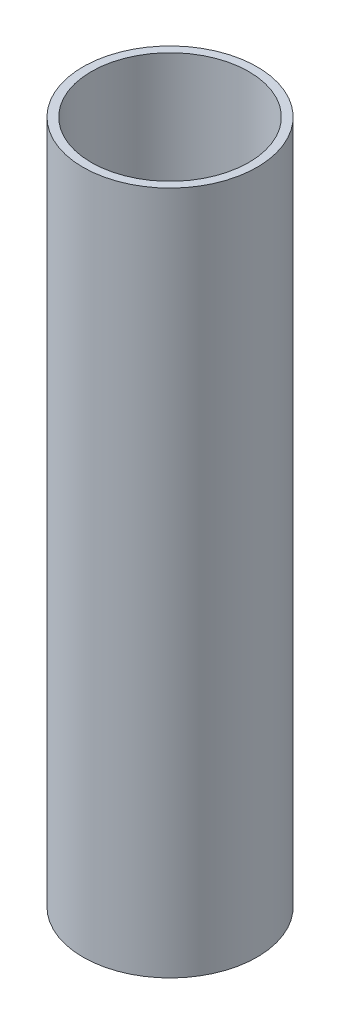
ISO-10303-21;
HEADER;
FILE_DESCRIPTION(('STEP AP214'),'2;1');
FILE_NAME('part.step','',(''),(''),'','','');
FILE_SCHEMA(('AUTOMOTIVE_DESIGN { 1 0 10303 214 1 1 1 1 }'));
ENDSEC;
DATA;
#1=APPLICATION_CONTEXT('core data for automotive mechanical design processes');
#2=APPLICATION_PROTOCOL_DEFINITION('international standard','automotive_design',2000,#1);
#3=PRODUCT_CONTEXT('',#1,'mechanical');
#4=PRODUCT('Part','Part','',(#3));
#5=PRODUCT_RELATED_PRODUCT_CATEGORY('part','',(#4));
#6=PRODUCT_DEFINITION_FORMATION('','',#4);
#7=PRODUCT_DEFINITION_CONTEXT('part definition',#1,'design');
#8=PRODUCT_DEFINITION('design','',#6,#7);
#9=PRODUCT_DEFINITION_SHAPE('','',#8);
#10=(LENGTH_UNIT() NAMED_UNIT(*) SI_UNIT(.MILLI.,.METRE.));
#11=(NAMED_UNIT(*) PLANE_ANGLE_UNIT() SI_UNIT($,.RADIAN.));
#12=(NAMED_UNIT(*) SI_UNIT($,.STERADIAN.) SOLID_ANGLE_UNIT());
#13=UNCERTAINTY_MEASURE_WITH_UNIT(LENGTH_MEASURE(1.E-05),#10,'distance_accuracy_value','');
#14=(GEOMETRIC_REPRESENTATION_CONTEXT(3) GLOBAL_UNCERTAINTY_ASSIGNED_CONTEXT((#13)) GLOBAL_UNIT_ASSIGNED_CONTEXT((#10,
#11,#12)) REPRESENTATION_CONTEXT('',''));
#15=CARTESIAN_POINT('',(0.,0.,0.));
#16=DIRECTION('',(0.,0.,1.));
#17=DIRECTION('',(1.,0.,0.));
#18=AXIS2_PLACEMENT_3D('',#15,#16,#17);
#19=CARTESIAN_POINT('',(0.,165.,0.));
#20=DIRECTION('',(0.,1.,0.));
#21=DIRECTION('',(0.,0.,1.));
#22=AXIS2_PLACEMENT_3D('',#19,#20,#21);
#23=PLANE('',#22);
#24=CARTESIAN_POINT('',(0.,165.,0.));
#25=DIRECTION('',(0.,1.,0.));
#26=DIRECTION('',(0.,0.,1.));
#27=AXIS2_PLACEMENT_3D('',#24,#25,#26);
#28=CIRCLE('',#27,21.);
#29=CARTESIAN_POINT('',(0.,165.,21.));
#30=VERTEX_POINT('',#29);
#31=EDGE_CURVE('E10',#30,#30,#28,.T.);
#32=ORIENTED_EDGE('',*,*,#31,.T.);
#33=EDGE_LOOP('',(#32));
#34=FACE_BOUND('',#33,.T.);
#35=CARTESIAN_POINT('',(0.,165.,0.));
#36=DIRECTION('',(0.,1.,0.));
#37=DIRECTION('',(0.,0.,1.));
#38=AXIS2_PLACEMENT_3D('',#35,#36,#37);
#39=CIRCLE('',#38,19.);
#40=CARTESIAN_POINT('',(0.,165.,19.));
#41=VERTEX_POINT('',#40);
#42=EDGE_CURVE('E50',#41,#41,#39,.T.);
#43=ORIENTED_EDGE('',*,*,#42,.F.);
#44=EDGE_LOOP('',(#43));
#45=FACE_BOUND('',#44,.T.);
#46=ADVANCED_FACE('F37',(#34,#45),#23,.T.);
#47=CARTESIAN_POINT('',(0.,0.,0.));
#48=DIRECTION('',(0.,1.,0.));
#49=DIRECTION('',(0.,0.,1.));
#50=AXIS2_PLACEMENT_3D('',#47,#48,#49);
#51=PLANE('',#50);
#52=CARTESIAN_POINT('',(0.,0.,0.));
#53=DIRECTION('',(0.,1.,0.));
#54=DIRECTION('',(0.,0.,1.));
#55=AXIS2_PLACEMENT_3D('',#52,#53,#54);
#56=CIRCLE('',#55,21.);
#57=CARTESIAN_POINT('',(0.,0.,21.));
#58=VERTEX_POINT('',#57);
#59=EDGE_CURVE('E41',#58,#58,#56,.T.);
#60=ORIENTED_EDGE('',*,*,#59,.F.);
#61=EDGE_LOOP('',(#60));
#62=FACE_BOUND('',#61,.T.);
#63=CARTESIAN_POINT('',(0.,0.,0.));
#64=DIRECTION('',(0.,1.,0.));
#65=DIRECTION('',(0.,0.,1.));
#66=AXIS2_PLACEMENT_3D('',#63,#64,#65);
#67=CIRCLE('',#66,19.);
#68=CARTESIAN_POINT('',(0.,0.,19.));
#69=VERTEX_POINT('',#68);
#70=EDGE_CURVE('E52',#69,#69,#67,.T.);
#71=ORIENTED_EDGE('',*,*,#70,.T.);
#72=EDGE_LOOP('',(#71));
#73=FACE_BOUND('',#72,.T.);
#74=ADVANCED_FACE('F64',(#62,#73),#51,.F.);
#75=CARTESIAN_POINT('',(0.,165.,0.));
#76=DIRECTION('',(0.,-1.,0.));
#77=DIRECTION('',(0.,0.,-1.));
#78=AXIS2_PLACEMENT_3D('',#75,#76,#77);
#79=CYLINDRICAL_SURFACE('',#78,21.);
#80=ORIENTED_EDGE('',*,*,#31,.F.);
#81=EDGE_LOOP('',(#80));
#82=FACE_BOUND('',#81,.T.);
#83=ORIENTED_EDGE('',*,*,#59,.T.);
#84=EDGE_LOOP('',(#83));
#85=FACE_BOUND('',#84,.T.);
#86=ADVANCED_FACE('F39',(#82,#85),#79,.T.);
#87=CARTESIAN_POINT('',(0.,165.,0.));
#88=DIRECTION('',(0.,-1.,0.));
#89=DIRECTION('',(0.,0.,-1.));
#90=AXIS2_PLACEMENT_3D('',#87,#88,#89);
#91=CYLINDRICAL_SURFACE('',#90,19.);
#92=ORIENTED_EDGE('',*,*,#42,.T.);
#93=EDGE_LOOP('',(#92));
#94=FACE_BOUND('',#93,.T.);
#95=ORIENTED_EDGE('',*,*,#70,.F.);
#96=EDGE_LOOP('',(#95));
#97=FACE_BOUND('',#96,.T.);
#98=ADVANCED_FACE('F60',(#94,#97),#91,.F.);
#99=CLOSED_SHELL('',(#46,#74,#86,#98));
#100=MANIFOLD_SOLID_BREP('B2',#99);
#101=ADVANCED_BREP_SHAPE_REPRESENTATION('',(#18,#100),#14);
#102=SHAPE_DEFINITION_REPRESENTATION(#9,#101);
ENDSEC;
END-ISO-10303-21;
